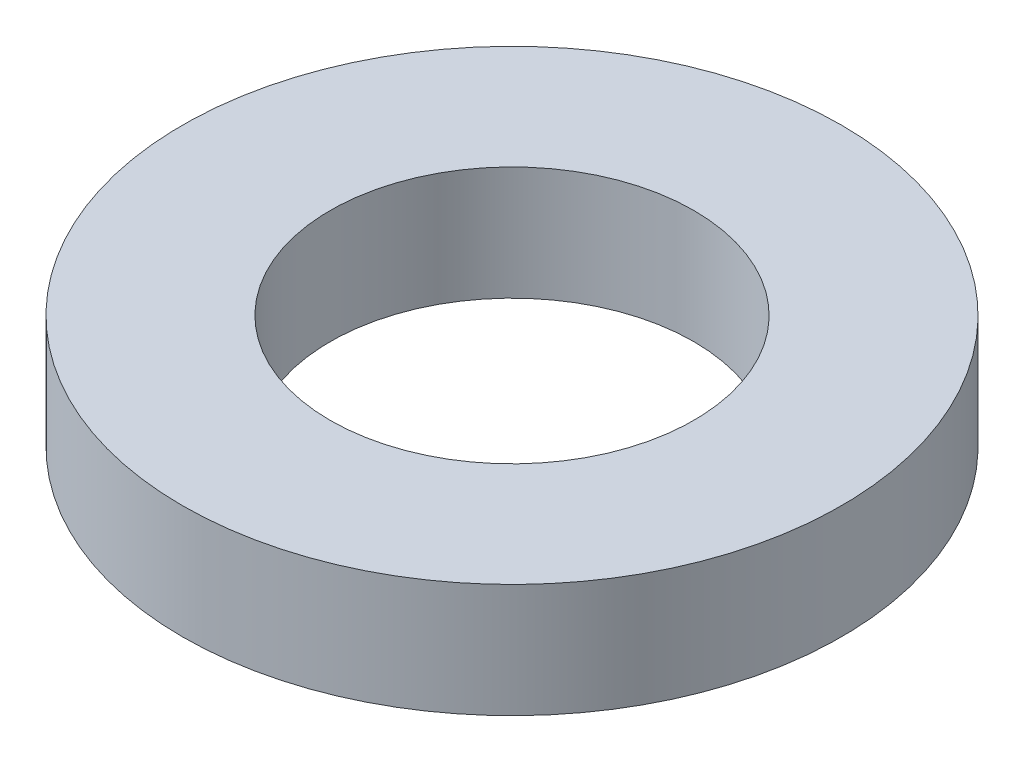
ISO-10303-21;
HEADER;
FILE_DESCRIPTION(('STEP AP214'),'2;1');
FILE_NAME('part.step','',(''),(''),'','','');
FILE_SCHEMA(('AUTOMOTIVE_DESIGN { 1 0 10303 214 1 1 1 1 }'));
ENDSEC;
DATA;
#1=APPLICATION_CONTEXT('core data for automotive mechanical design processes');
#2=APPLICATION_PROTOCOL_DEFINITION('international standard','automotive_design',2000,#1);
#3=PRODUCT_CONTEXT('',#1,'mechanical');
#4=PRODUCT('Part','Part','',(#3));
#5=PRODUCT_RELATED_PRODUCT_CATEGORY('part','',(#4));
#6=PRODUCT_DEFINITION_FORMATION('','',#4);
#7=PRODUCT_DEFINITION_CONTEXT('part definition',#1,'design');
#8=PRODUCT_DEFINITION('design','',#6,#7);
#9=PRODUCT_DEFINITION_SHAPE('','',#8);
#10=(LENGTH_UNIT() NAMED_UNIT(*) SI_UNIT(.MILLI.,.METRE.));
#11=(NAMED_UNIT(*) PLANE_ANGLE_UNIT() SI_UNIT($,.RADIAN.));
#12=(NAMED_UNIT(*) SI_UNIT($,.STERADIAN.) SOLID_ANGLE_UNIT());
#13=UNCERTAINTY_MEASURE_WITH_UNIT(LENGTH_MEASURE(1.E-05),#10,'distance_accuracy_value','');
#14=(GEOMETRIC_REPRESENTATION_CONTEXT(3) GLOBAL_UNCERTAINTY_ASSIGNED_CONTEXT((#13)) GLOBAL_UNIT_ASSIGNED_CONTEXT((#10,
#11,#12)) REPRESENTATION_CONTEXT('',''));
#15=CARTESIAN_POINT('',(0.,0.,0.));
#16=DIRECTION('',(0.,0.,1.));
#17=DIRECTION('',(1.,0.,0.));
#18=AXIS2_PLACEMENT_3D('',#15,#16,#17);
#19=CARTESIAN_POINT('',(0.,25.,0.));
#20=DIRECTION('',(0.,-1.,0.));
#21=DIRECTION('',(0.,0.,-1.));
#22=AXIS2_PLACEMENT_3D('',#19,#20,#21);
#23=CYLINDRICAL_SURFACE('',#22,72.5);
#24=CARTESIAN_POINT('',(0.,25.,0.));
#25=DIRECTION('',(0.,1.,0.));
#26=DIRECTION('',(0.,0.,1.));
#27=AXIS2_PLACEMENT_3D('',#24,#25,#26);
#28=CIRCLE('',#27,72.5);
#29=CARTESIAN_POINT('',(0.,25.,72.5));
#30=VERTEX_POINT('',#29);
#31=EDGE_CURVE('E10',#30,#30,#28,.T.);
#32=ORIENTED_EDGE('',*,*,#31,.F.);
#33=EDGE_LOOP('',(#32));
#34=FACE_BOUND('',#33,.T.);
#35=CARTESIAN_POINT('',(0.,0.,0.));
#36=DIRECTION('',(0.,1.,0.));
#37=DIRECTION('',(0.,0.,1.));
#38=AXIS2_PLACEMENT_3D('',#35,#36,#37);
#39=CIRCLE('',#38,72.5);
#40=CARTESIAN_POINT('',(0.,0.,72.5));
#41=VERTEX_POINT('',#40);
#42=EDGE_CURVE('E37',#41,#41,#39,.T.);
#43=ORIENTED_EDGE('',*,*,#42,.T.);
#44=EDGE_LOOP('',(#43));
#45=FACE_BOUND('',#44,.T.);
#46=ADVANCED_FACE('F40',(#34,#45),#23,.T.);
#47=CARTESIAN_POINT('',(0.,25.,0.));
#48=DIRECTION('',(0.,1.,0.));
#49=DIRECTION('',(0.,0.,1.));
#50=AXIS2_PLACEMENT_3D('',#47,#48,#49);
#51=PLANE('',#50);
#52=CARTESIAN_POINT('',(0.,25.,0.));
#53=DIRECTION('',(0.,1.,0.));
#54=DIRECTION('',(0.,0.,1.));
#55=AXIS2_PLACEMENT_3D('',#52,#53,#54);
#56=CIRCLE('',#55,40.);
#57=CARTESIAN_POINT('',(0.,25.,40.));
#58=VERTEX_POINT('',#57);
#59=EDGE_CURVE('E50',#58,#58,#56,.T.);
#60=ORIENTED_EDGE('',*,*,#59,.F.);
#61=EDGE_LOOP('',(#60));
#62=FACE_BOUND('',#61,.T.);
#63=ORIENTED_EDGE('',*,*,#31,.T.);
#64=EDGE_LOOP('',(#63));
#65=FACE_BOUND('',#64,.T.);
#66=ADVANCED_FACE('F59',(#62,#65),#51,.T.);
#67=CARTESIAN_POINT('',(0.,0.,0.));
#68=DIRECTION('',(0.,1.,0.));
#69=DIRECTION('',(0.,0.,1.));
#70=AXIS2_PLACEMENT_3D('',#67,#68,#69);
#71=PLANE('',#70);
#72=CARTESIAN_POINT('',(0.,0.,0.));
#73=DIRECTION('',(0.,1.,0.));
#74=DIRECTION('',(0.,0.,1.));
#75=AXIS2_PLACEMENT_3D('',#72,#73,#74);
#76=CIRCLE('',#75,40.);
#77=CARTESIAN_POINT('',(0.,0.,40.));
#78=VERTEX_POINT('',#77);
#79=EDGE_CURVE('E47',#78,#78,#76,.T.);
#80=ORIENTED_EDGE('',*,*,#79,.T.);
#81=EDGE_LOOP('',(#80));
#82=FACE_BOUND('',#81,.T.);
#83=ORIENTED_EDGE('',*,*,#42,.F.);
#84=EDGE_LOOP('',(#83));
#85=FACE_BOUND('',#84,.T.);
#86=ADVANCED_FACE('F58',(#82,#85),#71,.F.);
#87=CARTESIAN_POINT('',(0.,25.,0.));
#88=DIRECTION('',(0.,-1.,0.));
#89=DIRECTION('',(0.,0.,-1.));
#90=AXIS2_PLACEMENT_3D('',#87,#88,#89);
#91=CYLINDRICAL_SURFACE('',#90,40.);
#92=ORIENTED_EDGE('',*,*,#59,.T.);
#93=EDGE_LOOP('',(#92));
#94=FACE_BOUND('',#93,.T.);
#95=ORIENTED_EDGE('',*,*,#79,.F.);
#96=EDGE_LOOP('',(#95));
#97=FACE_BOUND('',#96,.T.);
#98=ADVANCED_FACE('F54',(#94,#97),#91,.F.);
#99=CLOSED_SHELL('',(#46,#66,#86,#98));
#100=MANIFOLD_SOLID_BREP('B2',#99);
#101=ADVANCED_BREP_SHAPE_REPRESENTATION('',(#18,#100),#14);
#102=SHAPE_DEFINITION_REPRESENTATION(#9,#101);
ENDSEC;
END-ISO-10303-21;
